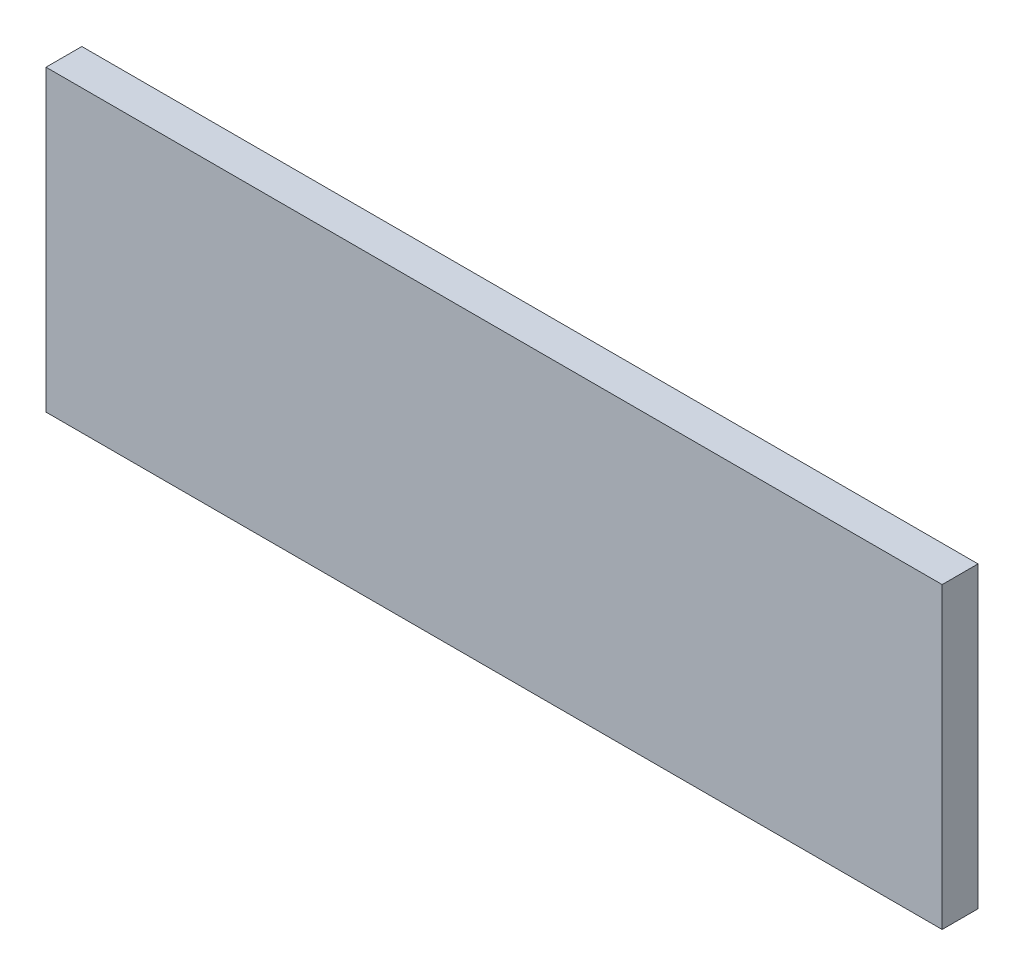
ISO-10303-21;
HEADER;
FILE_DESCRIPTION(('STEP AP214'),'2;1');
FILE_NAME('part.step','',(''),(''),'','','');
FILE_SCHEMA(('AUTOMOTIVE_DESIGN { 1 0 10303 214 1 1 1 1 }'));
ENDSEC;
DATA;
#1=APPLICATION_CONTEXT('core data for automotive mechanical design processes');
#2=APPLICATION_PROTOCOL_DEFINITION('international standard','automotive_design',2000,#1);
#3=PRODUCT_CONTEXT('',#1,'mechanical');
#4=PRODUCT('Part','Part','',(#3));
#5=PRODUCT_RELATED_PRODUCT_CATEGORY('part','',(#4));
#6=PRODUCT_DEFINITION_FORMATION('','',#4);
#7=PRODUCT_DEFINITION_CONTEXT('part definition',#1,'design');
#8=PRODUCT_DEFINITION('design','',#6,#7);
#9=PRODUCT_DEFINITION_SHAPE('','',#8);
#10=(LENGTH_UNIT() NAMED_UNIT(*) SI_UNIT(.MILLI.,.METRE.));
#11=(NAMED_UNIT(*) PLANE_ANGLE_UNIT() SI_UNIT($,.RADIAN.));
#12=(NAMED_UNIT(*) SI_UNIT($,.STERADIAN.) SOLID_ANGLE_UNIT());
#13=UNCERTAINTY_MEASURE_WITH_UNIT(LENGTH_MEASURE(1.E-05),#10,'distance_accuracy_value','');
#14=(GEOMETRIC_REPRESENTATION_CONTEXT(3) GLOBAL_UNCERTAINTY_ASSIGNED_CONTEXT((#13)) GLOBAL_UNIT_ASSIGNED_CONTEXT((#10,
#11,#12)) REPRESENTATION_CONTEXT('',''));
#15=CARTESIAN_POINT('',(0.,0.,0.));
#16=DIRECTION('',(0.,0.,1.));
#17=DIRECTION('',(1.,0.,0.));
#18=AXIS2_PLACEMENT_3D('',#15,#16,#17);
#19=CARTESIAN_POINT('',(0.,0.,-12.));
#20=DIRECTION('',(-1.,0.,0.));
#21=DIRECTION('',(0.,-1.,0.));
#22=AXIS2_PLACEMENT_3D('',#19,#20,#21);
#23=PLANE('',#22);
#24=DIRECTION('',(0.,-1.,0.));
#25=VECTOR('',#24,1.);
#26=CARTESIAN_POINT('',(0.,0.,0.));
#27=LINE('',#26,#25);
#28=CARTESIAN_POINT('',(0.,0.,0.));
#29=VERTEX_POINT('',#28);
#30=CARTESIAN_POINT('',(0.,-100.,0.));
#31=VERTEX_POINT('',#30);
#32=EDGE_CURVE('E102',#29,#31,#27,.T.);
#33=ORIENTED_EDGE('',*,*,#32,.F.);
#34=DIRECTION('',(0.,0.,1.));
#35=VECTOR('',#34,1.);
#36=CARTESIAN_POINT('',(0.,0.,-12.));
#37=LINE('',#36,#35);
#38=CARTESIAN_POINT('',(0.,0.,-12.));
#39=VERTEX_POINT('',#38);
#40=EDGE_CURVE('E11',#39,#29,#37,.T.);
#41=ORIENTED_EDGE('',*,*,#40,.F.);
#42=DIRECTION('',(0.,-1.,0.));
#43=VECTOR('',#42,1.);
#44=CARTESIAN_POINT('',(0.,0.,-12.));
#45=LINE('',#44,#43);
#46=CARTESIAN_POINT('',(0.,-100.,-12.));
#47=VERTEX_POINT('',#46);
#48=EDGE_CURVE('E96',#39,#47,#45,.T.);
#49=ORIENTED_EDGE('',*,*,#48,.T.);
#50=DIRECTION('',(0.,0.,1.));
#51=VECTOR('',#50,1.);
#52=CARTESIAN_POINT('',(0.,-100.,-12.));
#53=LINE('',#52,#51);
#54=EDGE_CURVE('E41',#47,#31,#53,.T.);
#55=ORIENTED_EDGE('',*,*,#54,.T.);
#56=EDGE_LOOP('',(#33,#41,#49,#55));
#57=FACE_BOUND('',#56,.T.);
#58=ADVANCED_FACE('F38',(#57),#23,.T.);
#59=CARTESIAN_POINT('',(0.,0.,-12.));
#60=DIRECTION('',(0.,1.,0.));
#61=DIRECTION('',(0.,0.,1.));
#62=AXIS2_PLACEMENT_3D('',#59,#60,#61);
#63=PLANE('',#62);
#64=DIRECTION('',(-1.,0.,0.));
#65=VECTOR('',#64,1.);
#66=CARTESIAN_POINT('',(0.,0.,0.));
#67=LINE('',#66,#65);
#68=CARTESIAN_POINT('',(300.,0.,0.));
#69=VERTEX_POINT('',#68);
#70=EDGE_CURVE('E98',#69,#29,#67,.T.);
#71=ORIENTED_EDGE('',*,*,#70,.F.);
#72=DIRECTION('',(0.,0.,1.));
#73=VECTOR('',#72,1.);
#74=CARTESIAN_POINT('',(300.,0.,-12.));
#75=LINE('',#74,#73);
#76=CARTESIAN_POINT('',(300.,0.,-12.));
#77=VERTEX_POINT('',#76);
#78=EDGE_CURVE('E47',#77,#69,#75,.T.);
#79=ORIENTED_EDGE('',*,*,#78,.F.);
#80=DIRECTION('',(-1.,0.,0.));
#81=VECTOR('',#80,1.);
#82=CARTESIAN_POINT('',(0.,0.,-12.));
#83=LINE('',#82,#81);
#84=EDGE_CURVE('E93',#77,#39,#83,.T.);
#85=ORIENTED_EDGE('',*,*,#84,.T.);
#86=ORIENTED_EDGE('',*,*,#40,.T.);
#87=EDGE_LOOP('',(#71,#79,#85,#86));
#88=FACE_BOUND('',#87,.T.);
#89=ADVANCED_FACE('F112',(#88),#63,.T.);
#90=CARTESIAN_POINT('',(300.,0.,-12.));
#91=DIRECTION('',(1.,0.,0.));
#92=DIRECTION('',(0.,1.,0.));
#93=AXIS2_PLACEMENT_3D('',#90,#91,#92);
#94=PLANE('',#93);
#95=DIRECTION('',(0.,1.,0.));
#96=VECTOR('',#95,1.);
#97=CARTESIAN_POINT('',(300.,0.,0.));
#98=LINE('',#97,#96);
#99=CARTESIAN_POINT('',(300.,-100.,0.));
#100=VERTEX_POINT('',#99);
#101=EDGE_CURVE('E88',#100,#69,#98,.T.);
#102=ORIENTED_EDGE('',*,*,#101,.F.);
#103=DIRECTION('',(0.,0.,1.));
#104=VECTOR('',#103,1.);
#105=CARTESIAN_POINT('',(300.,-100.,-12.));
#106=LINE('',#105,#104);
#107=CARTESIAN_POINT('',(300.,-100.,-12.));
#108=VERTEX_POINT('',#107);
#109=EDGE_CURVE('E83',#108,#100,#106,.T.);
#110=ORIENTED_EDGE('',*,*,#109,.F.);
#111=DIRECTION('',(0.,1.,0.));
#112=VECTOR('',#111,1.);
#113=CARTESIAN_POINT('',(300.,0.,-12.));
#114=LINE('',#113,#112);
#115=EDGE_CURVE('E86',#108,#77,#114,.T.);
#116=ORIENTED_EDGE('',*,*,#115,.T.);
#117=ORIENTED_EDGE('',*,*,#78,.T.);
#118=EDGE_LOOP('',(#102,#110,#116,#117));
#119=FACE_BOUND('',#118,.T.);
#120=ADVANCED_FACE('F85',(#119),#94,.T.);
#121=CARTESIAN_POINT('',(0.,-100.,-12.));
#122=DIRECTION('',(0.,-1.,0.));
#123=DIRECTION('',(0.,0.,-1.));
#124=AXIS2_PLACEMENT_3D('',#121,#122,#123);
#125=PLANE('',#124);
#126=DIRECTION('',(1.,0.,0.));
#127=VECTOR('',#126,1.);
#128=CARTESIAN_POINT('',(0.,-100.,0.));
#129=LINE('',#128,#127);
#130=EDGE_CURVE('E105',#31,#100,#129,.T.);
#131=ORIENTED_EDGE('',*,*,#130,.F.);
#132=ORIENTED_EDGE('',*,*,#54,.F.);
#133=DIRECTION('',(1.,0.,0.));
#134=VECTOR('',#133,1.);
#135=CARTESIAN_POINT('',(0.,-100.,-12.));
#136=LINE('',#135,#134);
#137=EDGE_CURVE('E92',#47,#108,#136,.T.);
#138=ORIENTED_EDGE('',*,*,#137,.T.);
#139=ORIENTED_EDGE('',*,*,#109,.T.);
#140=EDGE_LOOP('',(#131,#132,#138,#139));
#141=FACE_BOUND('',#140,.T.);
#142=ADVANCED_FACE('F95',(#141),#125,.T.);
#143=CARTESIAN_POINT('',(0.,0.,-12.));
#144=DIRECTION('',(0.,0.,1.));
#145=DIRECTION('',(1.,0.,0.));
#146=AXIS2_PLACEMENT_3D('',#143,#144,#145);
#147=PLANE('',#146);
#148=ORIENTED_EDGE('',*,*,#48,.F.);
#149=ORIENTED_EDGE('',*,*,#84,.F.);
#150=ORIENTED_EDGE('',*,*,#115,.F.);
#151=ORIENTED_EDGE('',*,*,#137,.F.);
#152=EDGE_LOOP('',(#148,#149,#150,#151));
#153=FACE_BOUND('',#152,.T.);
#154=ADVANCED_FACE('F91',(#153),#147,.F.);
#155=CARTESIAN_POINT('',(0.,0.,0.));
#156=DIRECTION('',(0.,0.,1.));
#157=DIRECTION('',(1.,0.,0.));
#158=AXIS2_PLACEMENT_3D('',#155,#156,#157);
#159=PLANE('',#158);
#160=ORIENTED_EDGE('',*,*,#32,.T.);
#161=ORIENTED_EDGE('',*,*,#130,.T.);
#162=ORIENTED_EDGE('',*,*,#101,.T.);
#163=ORIENTED_EDGE('',*,*,#70,.T.);
#164=EDGE_LOOP('',(#160,#161,#162,#163));
#165=FACE_BOUND('',#164,.T.);
#166=ADVANCED_FACE('F111',(#165),#159,.T.);
#167=CLOSED_SHELL('',(#58,#89,#120,#142,#154,#166));
#168=MANIFOLD_SOLID_BREP('B2',#167);
#169=ADVANCED_BREP_SHAPE_REPRESENTATION('',(#18,#168),#14);
#170=SHAPE_DEFINITION_REPRESENTATION(#9,#169);
ENDSEC;
END-ISO-10303-21;
